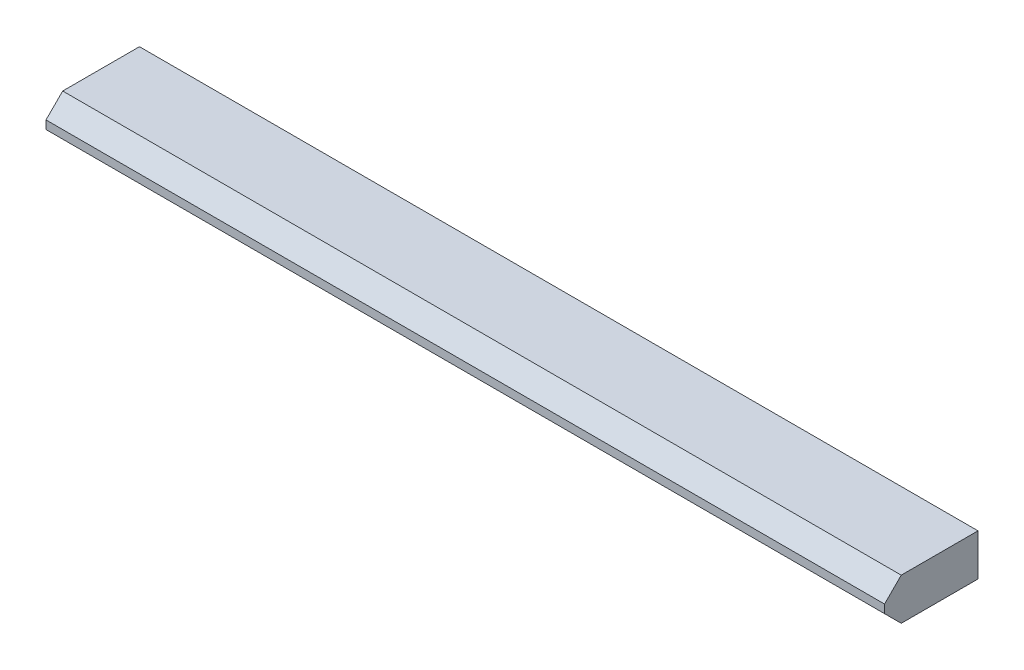
ISO-10303-21;
HEADER;
FILE_DESCRIPTION(('STEP AP214'),'2;1');
FILE_NAME('part.step','',(''),(''),'','','');
FILE_SCHEMA(('AUTOMOTIVE_DESIGN { 1 0 10303 214 1 1 1 1 }'));
ENDSEC;
DATA;
#1=APPLICATION_CONTEXT('core data for automotive mechanical design processes');
#2=APPLICATION_PROTOCOL_DEFINITION('international standard','automotive_design',2000,#1);
#3=PRODUCT_CONTEXT('',#1,'mechanical');
#4=PRODUCT('Part','Part','',(#3));
#5=PRODUCT_RELATED_PRODUCT_CATEGORY('part','',(#4));
#6=PRODUCT_DEFINITION_FORMATION('','',#4);
#7=PRODUCT_DEFINITION_CONTEXT('part definition',#1,'design');
#8=PRODUCT_DEFINITION('design','',#6,#7);
#9=PRODUCT_DEFINITION_SHAPE('','',#8);
#10=(LENGTH_UNIT() NAMED_UNIT(*) SI_UNIT(.MILLI.,.METRE.));
#11=(NAMED_UNIT(*) PLANE_ANGLE_UNIT() SI_UNIT($,.RADIAN.));
#12=(NAMED_UNIT(*) SI_UNIT($,.STERADIAN.) SOLID_ANGLE_UNIT());
#13=UNCERTAINTY_MEASURE_WITH_UNIT(LENGTH_MEASURE(1.E-05),#10,'distance_accuracy_value','');
#14=(GEOMETRIC_REPRESENTATION_CONTEXT(3) GLOBAL_UNCERTAINTY_ASSIGNED_CONTEXT((#13)) GLOBAL_UNIT_ASSIGNED_CONTEXT((#10,
#11,#12)) REPRESENTATION_CONTEXT('',''));
#15=CARTESIAN_POINT('',(0.,0.,0.));
#16=DIRECTION('',(0.,0.,1.));
#17=DIRECTION('',(1.,0.,0.));
#18=AXIS2_PLACEMENT_3D('',#15,#16,#17);
#19=CARTESIAN_POINT('',(-201.,0.,25.));
#20=DIRECTION('',(0.,0.,1.));
#21=DIRECTION('',(1.,0.,0.));
#22=AXIS2_PLACEMENT_3D('',#19,#20,#21);
#23=PLANE('',#22);
#24=DIRECTION('',(0.,1.,0.));
#25=VECTOR('',#24,1.);
#26=CARTESIAN_POINT('',(-201.,0.,25.));
#27=LINE('',#26,#25);
#28=CARTESIAN_POINT('',(-201.,8.,25.));
#29=VERTEX_POINT('',#28);
#30=CARTESIAN_POINT('',(-201.,12.,25.));
#31=VERTEX_POINT('',#30);
#32=EDGE_CURVE('E106',#29,#31,#27,.T.);
#33=ORIENTED_EDGE('',*,*,#32,.F.);
#34=DIRECTION('',(1.,0.,0.));
#35=VECTOR('',#34,1.);
#36=CARTESIAN_POINT('',(0.,8.,25.));
#37=LINE('',#36,#35);
#38=CARTESIAN_POINT('',(201.,8.,25.));
#39=VERTEX_POINT('',#38);
#40=EDGE_CURVE('E80',#39,#29,#37,.F.);
#41=ORIENTED_EDGE('',*,*,#40,.F.);
#42=DIRECTION('',(0.,1.,0.));
#43=VECTOR('',#42,1.);
#44=CARTESIAN_POINT('',(201.,0.,25.));
#45=LINE('',#44,#43);
#46=CARTESIAN_POINT('',(201.,12.,25.));
#47=VERTEX_POINT('',#46);
#48=EDGE_CURVE('E89',#47,#39,#45,.F.);
#49=ORIENTED_EDGE('',*,*,#48,.F.);
#50=DIRECTION('',(1.,0.,0.));
#51=VECTOR('',#50,1.);
#52=CARTESIAN_POINT('',(0.,12.,25.));
#53=LINE('',#52,#51);
#54=EDGE_CURVE('E20',#31,#47,#53,.T.);
#55=ORIENTED_EDGE('',*,*,#54,.F.);
#56=EDGE_LOOP('',(#33,#41,#49,#55));
#57=FACE_BOUND('',#56,.T.);
#58=ADVANCED_FACE('F17',(#57),#23,.T.);
#59=CARTESIAN_POINT('',(0.,16.,21.));
#60=DIRECTION('',(0.,0.707106781186548,0.707106781186548));
#61=DIRECTION('',(0.,-0.707106781186548,0.707106781186548));
#62=AXIS2_PLACEMENT_3D('',#59,#60,#61);
#63=PLANE('',#62);
#64=ORIENTED_EDGE('',*,*,#54,.T.);
#65=DIRECTION('',(0.,-0.707106781186548,0.707106781186548));
#66=VECTOR('',#65,1.);
#67=CARTESIAN_POINT('',(201.,20.,17.));
#68=LINE('',#67,#66);
#69=CARTESIAN_POINT('',(201.,20.,17.));
#70=VERTEX_POINT('',#69);
#71=EDGE_CURVE('E83',#70,#47,#68,.T.);
#72=ORIENTED_EDGE('',*,*,#71,.F.);
#73=DIRECTION('',(1.,0.,0.));
#74=VECTOR('',#73,1.);
#75=CARTESIAN_POINT('',(0.,20.,17.));
#76=LINE('',#75,#74);
#77=CARTESIAN_POINT('',(-201.,20.,17.));
#78=VERTEX_POINT('',#77);
#79=EDGE_CURVE('E73',#78,#70,#76,.T.);
#80=ORIENTED_EDGE('',*,*,#79,.F.);
#81=DIRECTION('',(0.,0.707106781186547,-0.707106781186548));
#82=VECTOR('',#81,1.);
#83=CARTESIAN_POINT('',(-201.,12.,25.));
#84=LINE('',#83,#82);
#85=EDGE_CURVE('E109',#31,#78,#84,.T.);
#86=ORIENTED_EDGE('',*,*,#85,.F.);
#87=EDGE_LOOP('',(#64,#72,#80,#86));
#88=FACE_BOUND('',#87,.T.);
#89=ADVANCED_FACE('F88',(#88),#63,.T.);
#90=CARTESIAN_POINT('',(0.,20.,0.));
#91=DIRECTION('',(0.,1.,0.));
#92=DIRECTION('',(0.,0.,1.));
#93=AXIS2_PLACEMENT_3D('',#90,#91,#92);
#94=PLANE('',#93);
#95=DIRECTION('',(0.,0.,1.));
#96=VECTOR('',#95,1.);
#97=CARTESIAN_POINT('',(-201.,20.,-19.8));
#98=LINE('',#97,#96);
#99=CARTESIAN_POINT('',(-201.,20.,-19.8));
#100=VERTEX_POINT('',#99);
#101=EDGE_CURVE('E79',#78,#100,#98,.F.);
#102=ORIENTED_EDGE('',*,*,#101,.F.);
#103=ORIENTED_EDGE('',*,*,#79,.T.);
#104=DIRECTION('',(0.,0.,-1.));
#105=VECTOR('',#104,1.);
#106=CARTESIAN_POINT('',(201.,20.,25.));
#107=LINE('',#106,#105);
#108=CARTESIAN_POINT('',(201.,20.,-19.8));
#109=VERTEX_POINT('',#108);
#110=EDGE_CURVE('E77',#109,#70,#107,.F.);
#111=ORIENTED_EDGE('',*,*,#110,.F.);
#112=DIRECTION('',(-1.,0.,0.));
#113=VECTOR('',#112,1.);
#114=CARTESIAN_POINT('',(201.,20.,-19.8));
#115=LINE('',#114,#113);
#116=EDGE_CURVE('E112',#100,#109,#115,.F.);
#117=ORIENTED_EDGE('',*,*,#116,.F.);
#118=EDGE_LOOP('',(#102,#103,#111,#117));
#119=FACE_BOUND('',#118,.T.);
#120=ADVANCED_FACE('F75',(#119),#94,.T.);
#121=CARTESIAN_POINT('',(0.,4.,21.));
#122=DIRECTION('',(0.,-0.707106781186548,0.707106781186548));
#123=DIRECTION('',(0.,-0.707106781186548,-0.707106781186548));
#124=AXIS2_PLACEMENT_3D('',#121,#122,#123);
#125=PLANE('',#124);
#126=ORIENTED_EDGE('',*,*,#40,.T.);
#127=DIRECTION('',(0.,0.707106781186547,0.707106781186548));
#128=VECTOR('',#127,1.);
#129=CARTESIAN_POINT('',(-201.,0.,17.));
#130=LINE('',#129,#128);
#131=CARTESIAN_POINT('',(-201.,0.,17.));
#132=VERTEX_POINT('',#131);
#133=EDGE_CURVE('E102',#132,#29,#130,.T.);
#134=ORIENTED_EDGE('',*,*,#133,.F.);
#135=DIRECTION('',(1.,0.,0.));
#136=VECTOR('',#135,1.);
#137=CARTESIAN_POINT('',(0.,0.,17.));
#138=LINE('',#137,#136);
#139=CARTESIAN_POINT('',(201.,0.,17.));
#140=VERTEX_POINT('',#139);
#141=EDGE_CURVE('E107',#132,#140,#138,.T.);
#142=ORIENTED_EDGE('',*,*,#141,.T.);
#143=DIRECTION('',(0.,-0.707106781186548,-0.707106781186548));
#144=VECTOR('',#143,1.);
#145=CARTESIAN_POINT('',(201.,8.,25.));
#146=LINE('',#145,#144);
#147=EDGE_CURVE('E91',#39,#140,#146,.T.);
#148=ORIENTED_EDGE('',*,*,#147,.F.);
#149=EDGE_LOOP('',(#126,#134,#142,#148));
#150=FACE_BOUND('',#149,.T.);
#151=ADVANCED_FACE('F100',(#150),#125,.T.);
#152=CARTESIAN_POINT('',(201.,0.,25.));
#153=DIRECTION('',(1.,0.,0.));
#154=DIRECTION('',(0.,0.,-1.));
#155=AXIS2_PLACEMENT_3D('',#152,#153,#154);
#156=PLANE('',#155);
#157=ORIENTED_EDGE('',*,*,#48,.T.);
#158=ORIENTED_EDGE('',*,*,#147,.T.);
#159=DIRECTION('',(0.,0.,1.));
#160=VECTOR('',#159,1.);
#161=CARTESIAN_POINT('',(201.,0.,0.));
#162=LINE('',#161,#160);
#163=CARTESIAN_POINT('',(201.,0.,-19.8));
#164=VERTEX_POINT('',#163);
#165=EDGE_CURVE('E117',#140,#164,#162,.F.);
#166=ORIENTED_EDGE('',*,*,#165,.T.);
#167=DIRECTION('',(0.,1.,0.));
#168=VECTOR('',#167,1.);
#169=CARTESIAN_POINT('',(201.,0.,-19.8));
#170=LINE('',#169,#168);
#171=EDGE_CURVE('E86',#109,#164,#170,.F.);
#172=ORIENTED_EDGE('',*,*,#171,.F.);
#173=ORIENTED_EDGE('',*,*,#110,.T.);
#174=ORIENTED_EDGE('',*,*,#71,.T.);
#175=EDGE_LOOP('',(#157,#158,#166,#172,#173,#174));
#176=FACE_BOUND('',#175,.T.);
#177=ADVANCED_FACE('F82',(#176),#156,.T.);
#178=CARTESIAN_POINT('',(201.,0.,-19.8));
#179=DIRECTION('',(0.,0.,-1.));
#180=DIRECTION('',(-1.,0.,0.));
#181=AXIS2_PLACEMENT_3D('',#178,#179,#180);
#182=PLANE('',#181);
#183=ORIENTED_EDGE('',*,*,#171,.T.);
#184=DIRECTION('',(1.,0.,0.));
#185=VECTOR('',#184,1.);
#186=CARTESIAN_POINT('',(0.,0.,-19.8));
#187=LINE('',#186,#185);
#188=CARTESIAN_POINT('',(-201.,0.,-19.8));
#189=VERTEX_POINT('',#188);
#190=EDGE_CURVE('E26',#164,#189,#187,.F.);
#191=ORIENTED_EDGE('',*,*,#190,.T.);
#192=DIRECTION('',(0.,1.,0.));
#193=VECTOR('',#192,1.);
#194=CARTESIAN_POINT('',(-201.,0.,-19.8));
#195=LINE('',#194,#193);
#196=EDGE_CURVE('E34',#100,#189,#195,.F.);
#197=ORIENTED_EDGE('',*,*,#196,.F.);
#198=ORIENTED_EDGE('',*,*,#116,.T.);
#199=EDGE_LOOP('',(#183,#191,#197,#198));
#200=FACE_BOUND('',#199,.T.);
#201=ADVANCED_FACE('F127',(#200),#182,.T.);
#202=CARTESIAN_POINT('',(-201.,0.,-19.8));
#203=DIRECTION('',(-1.,0.,0.));
#204=DIRECTION('',(0.,0.,1.));
#205=AXIS2_PLACEMENT_3D('',#202,#203,#204);
#206=PLANE('',#205);
#207=DIRECTION('',(0.,0.,1.));
#208=VECTOR('',#207,1.);
#209=CARTESIAN_POINT('',(-201.,0.,0.));
#210=LINE('',#209,#208);
#211=EDGE_CURVE('E11',#189,#132,#210,.T.);
#212=ORIENTED_EDGE('',*,*,#211,.T.);
#213=ORIENTED_EDGE('',*,*,#133,.T.);
#214=ORIENTED_EDGE('',*,*,#32,.T.);
#215=ORIENTED_EDGE('',*,*,#85,.T.);
#216=ORIENTED_EDGE('',*,*,#101,.T.);
#217=ORIENTED_EDGE('',*,*,#196,.T.);
#218=EDGE_LOOP('',(#212,#213,#214,#215,#216,#217));
#219=FACE_BOUND('',#218,.T.);
#220=ADVANCED_FACE('F105',(#219),#206,.T.);
#221=CARTESIAN_POINT('',(0.,0.,0.));
#222=DIRECTION('',(0.,1.,0.));
#223=DIRECTION('',(0.,0.,1.));
#224=AXIS2_PLACEMENT_3D('',#221,#222,#223);
#225=PLANE('',#224);
#226=ORIENTED_EDGE('',*,*,#190,.F.);
#227=ORIENTED_EDGE('',*,*,#165,.F.);
#228=ORIENTED_EDGE('',*,*,#141,.F.);
#229=ORIENTED_EDGE('',*,*,#211,.F.);
#230=EDGE_LOOP('',(#226,#227,#228,#229));
#231=FACE_BOUND('',#230,.T.);
#232=ADVANCED_FACE('F120',(#231),#225,.F.);
#233=CLOSED_SHELL('',(#58,#89,#120,#151,#177,#201,#220,#232));
#234=MANIFOLD_SOLID_BREP('B1',#233);
#235=ADVANCED_BREP_SHAPE_REPRESENTATION('',(#18,#234),#14);
#236=SHAPE_DEFINITION_REPRESENTATION(#9,#235);
ENDSEC;
END-ISO-10303-21;
